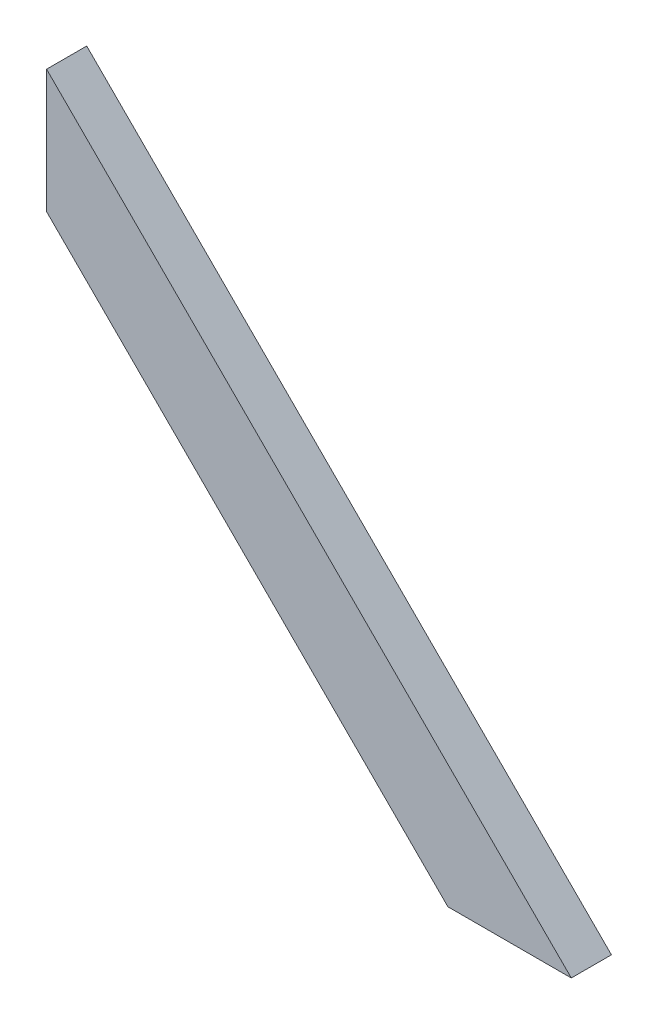
ISO-10303-21;
HEADER;
FILE_DESCRIPTION(('STEP AP214'),'2;1');
FILE_NAME('part.step','',(''),(''),'','','');
FILE_SCHEMA(('AUTOMOTIVE_DESIGN { 1 0 10303 214 1 1 1 1 }'));
ENDSEC;
DATA;
#1=APPLICATION_CONTEXT('core data for automotive mechanical design processes');
#2=APPLICATION_PROTOCOL_DEFINITION('international standard','automotive_design',2000,#1);
#3=PRODUCT_CONTEXT('',#1,'mechanical');
#4=PRODUCT('Part','Part','',(#3));
#5=PRODUCT_RELATED_PRODUCT_CATEGORY('part','',(#4));
#6=PRODUCT_DEFINITION_FORMATION('','',#4);
#7=PRODUCT_DEFINITION_CONTEXT('part definition',#1,'design');
#8=PRODUCT_DEFINITION('design','',#6,#7);
#9=PRODUCT_DEFINITION_SHAPE('','',#8);
#10=(LENGTH_UNIT() NAMED_UNIT(*) SI_UNIT(.MILLI.,.METRE.));
#11=(NAMED_UNIT(*) PLANE_ANGLE_UNIT() SI_UNIT($,.RADIAN.));
#12=(NAMED_UNIT(*) SI_UNIT($,.STERADIAN.) SOLID_ANGLE_UNIT());
#13=UNCERTAINTY_MEASURE_WITH_UNIT(LENGTH_MEASURE(1.E-05),#10,'distance_accuracy_value','');
#14=(GEOMETRIC_REPRESENTATION_CONTEXT(3) GLOBAL_UNCERTAINTY_ASSIGNED_CONTEXT((#13)) GLOBAL_UNIT_ASSIGNED_CONTEXT((#10,
#11,#12)) REPRESENTATION_CONTEXT('',''));
#15=CARTESIAN_POINT('',(0.,0.,0.));
#16=DIRECTION('',(0.,0.,1.));
#17=DIRECTION('',(1.,0.,0.));
#18=AXIS2_PLACEMENT_3D('',#15,#16,#17);
#19=CARTESIAN_POINT('',(0.,202.216763090675,23.));
#20=DIRECTION('',(1.,0.,0.));
#21=DIRECTION('',(0.,1.,0.));
#22=AXIS2_PLACEMENT_3D('',#19,#20,#21);
#23=PLANE('',#22);
#24=DIRECTION('',(0.,-1.,0.));
#25=VECTOR('',#24,1.);
#26=CARTESIAN_POINT('',(0.,202.216763090675,0.));
#27=LINE('',#26,#25);
#28=CARTESIAN_POINT('',(0.,202.216763090675,0.));
#29=VERTEX_POINT('',#28);
#30=CARTESIAN_POINT('',(0.,131.506084972021,0.));
#31=VERTEX_POINT('',#30);
#32=EDGE_CURVE('E95',#29,#31,#27,.T.);
#33=ORIENTED_EDGE('',*,*,#32,.T.);
#34=DIRECTION('',(0.,0.,-1.));
#35=VECTOR('',#34,1.);
#36=CARTESIAN_POINT('',(0.,131.506084972021,23.));
#37=LINE('',#36,#35);
#38=CARTESIAN_POINT('',(0.,131.506084972021,23.));
#39=VERTEX_POINT('',#38);
#40=EDGE_CURVE('E11',#39,#31,#37,.T.);
#41=ORIENTED_EDGE('',*,*,#40,.F.);
#42=DIRECTION('',(0.,-1.,0.));
#43=VECTOR('',#42,1.);
#44=CARTESIAN_POINT('',(0.,202.216763090675,23.));
#45=LINE('',#44,#43);
#46=CARTESIAN_POINT('',(0.,202.216763090675,23.));
#47=VERTEX_POINT('',#46);
#48=EDGE_CURVE('E83',#47,#39,#45,.T.);
#49=ORIENTED_EDGE('',*,*,#48,.F.);
#50=DIRECTION('',(0.,0.,-1.));
#51=VECTOR('',#50,1.);
#52=CARTESIAN_POINT('',(0.,202.216763090675,23.));
#53=LINE('',#52,#51);
#54=EDGE_CURVE('E91',#47,#29,#53,.T.);
#55=ORIENTED_EDGE('',*,*,#54,.T.);
#56=EDGE_LOOP('',(#33,#41,#49,#55));
#57=FACE_BOUND('',#56,.T.);
#58=ADVANCED_FACE('F32',(#57),#23,.F.);
#59=CARTESIAN_POINT('',(0.,131.506084972021,23.));
#60=DIRECTION('',(0.707106781186548,0.707106781186548,0.));
#61=DIRECTION('',(-0.707106781186548,0.707106781186548,0.));
#62=AXIS2_PLACEMENT_3D('',#59,#60,#61);
#63=PLANE('',#62);
#64=DIRECTION('',(0.707106781186547,-0.707106781186547,0.));
#65=VECTOR('',#64,1.);
#66=CARTESIAN_POINT('',(0.,131.506084972021,0.));
#67=LINE('',#66,#65);
#68=CARTESIAN_POINT('',(230.,-98.4939150279795,0.));
#69=VERTEX_POINT('',#68);
#70=EDGE_CURVE('E87',#31,#69,#67,.T.);
#71=ORIENTED_EDGE('',*,*,#70,.T.);
#72=DIRECTION('',(0.,0.,-1.));
#73=VECTOR('',#72,1.);
#74=CARTESIAN_POINT('',(230.,-98.4939150279795,23.));
#75=LINE('',#74,#73);
#76=CARTESIAN_POINT('',(230.,-98.4939150279795,23.));
#77=VERTEX_POINT('',#76);
#78=EDGE_CURVE('E40',#77,#69,#75,.T.);
#79=ORIENTED_EDGE('',*,*,#78,.F.);
#80=DIRECTION('',(0.707106781186547,-0.707106781186547,0.));
#81=VECTOR('',#80,1.);
#82=CARTESIAN_POINT('',(0.,131.506084972021,23.));
#83=LINE('',#82,#81);
#84=EDGE_CURVE('E78',#39,#77,#83,.T.);
#85=ORIENTED_EDGE('',*,*,#84,.F.);
#86=ORIENTED_EDGE('',*,*,#40,.T.);
#87=EDGE_LOOP('',(#71,#79,#85,#86));
#88=FACE_BOUND('',#87,.T.);
#89=ADVANCED_FACE('F86',(#88),#63,.F.);
#90=CARTESIAN_POINT('',(230.,-98.4939150279795,23.));
#91=DIRECTION('',(0.,1.,0.));
#92=DIRECTION('',(-1.,0.,0.));
#93=AXIS2_PLACEMENT_3D('',#90,#91,#92);
#94=PLANE('',#93);
#95=DIRECTION('',(1.,0.,0.));
#96=VECTOR('',#95,1.);
#97=CARTESIAN_POINT('',(230.,-98.4939150279795,0.));
#98=LINE('',#97,#96);
#99=CARTESIAN_POINT('',(300.710678118655,-98.4939150279795,0.));
#100=VERTEX_POINT('',#99);
#101=EDGE_CURVE('E65',#69,#100,#98,.T.);
#102=ORIENTED_EDGE('',*,*,#101,.T.);
#103=DIRECTION('',(0.,0.,-1.));
#104=VECTOR('',#103,1.);
#105=CARTESIAN_POINT('',(300.710678118655,-98.4939150279795,23.));
#106=LINE('',#105,#104);
#107=CARTESIAN_POINT('',(300.710678118655,-98.4939150279795,23.));
#108=VERTEX_POINT('',#107);
#109=EDGE_CURVE('E88',#108,#100,#106,.T.);
#110=ORIENTED_EDGE('',*,*,#109,.F.);
#111=DIRECTION('',(1.,0.,0.));
#112=VECTOR('',#111,1.);
#113=CARTESIAN_POINT('',(230.,-98.4939150279795,23.));
#114=LINE('',#113,#112);
#115=EDGE_CURVE('E81',#77,#108,#114,.T.);
#116=ORIENTED_EDGE('',*,*,#115,.F.);
#117=ORIENTED_EDGE('',*,*,#78,.T.);
#118=EDGE_LOOP('',(#102,#110,#116,#117));
#119=FACE_BOUND('',#118,.T.);
#120=ADVANCED_FACE('F89',(#119),#94,.F.);
#121=CARTESIAN_POINT('',(300.710678118655,-98.4939150279795,23.));
#122=DIRECTION('',(-0.707106781186547,-0.707106781186548,0.));
#123=DIRECTION('',(0.707106781186548,-0.707106781186547,0.));
#124=AXIS2_PLACEMENT_3D('',#121,#122,#123);
#125=PLANE('',#124);
#126=DIRECTION('',(-0.707106781186548,0.707106781186547,0.));
#127=VECTOR('',#126,1.);
#128=CARTESIAN_POINT('',(300.710678118655,-98.4939150279795,0.));
#129=LINE('',#128,#127);
#130=EDGE_CURVE('E71',#100,#29,#129,.T.);
#131=ORIENTED_EDGE('',*,*,#130,.T.);
#132=ORIENTED_EDGE('',*,*,#54,.F.);
#133=DIRECTION('',(-0.707106781186548,0.707106781186547,0.));
#134=VECTOR('',#133,1.);
#135=CARTESIAN_POINT('',(300.710678118655,-98.4939150279795,23.));
#136=LINE('',#135,#134);
#137=EDGE_CURVE('E48',#108,#47,#136,.T.);
#138=ORIENTED_EDGE('',*,*,#137,.F.);
#139=ORIENTED_EDGE('',*,*,#109,.T.);
#140=EDGE_LOOP('',(#131,#132,#138,#139));
#141=FACE_BOUND('',#140,.T.);
#142=ADVANCED_FACE('F102',(#141),#125,.F.);
#143=CARTESIAN_POINT('',(0.,0.,23.));
#144=DIRECTION('',(0.,0.,1.));
#145=DIRECTION('',(1.,0.,0.));
#146=AXIS2_PLACEMENT_3D('',#143,#144,#145);
#147=PLANE('',#146);
#148=ORIENTED_EDGE('',*,*,#48,.T.);
#149=ORIENTED_EDGE('',*,*,#84,.T.);
#150=ORIENTED_EDGE('',*,*,#115,.T.);
#151=ORIENTED_EDGE('',*,*,#137,.T.);
#152=EDGE_LOOP('',(#148,#149,#150,#151));
#153=FACE_BOUND('',#152,.T.);
#154=ADVANCED_FACE('F79',(#153),#147,.T.);
#155=CARTESIAN_POINT('',(0.,0.,0.));
#156=DIRECTION('',(0.,0.,1.));
#157=DIRECTION('',(1.,0.,0.));
#158=AXIS2_PLACEMENT_3D('',#155,#156,#157);
#159=PLANE('',#158);
#160=ORIENTED_EDGE('',*,*,#32,.F.);
#161=ORIENTED_EDGE('',*,*,#130,.F.);
#162=ORIENTED_EDGE('',*,*,#101,.F.);
#163=ORIENTED_EDGE('',*,*,#70,.F.);
#164=EDGE_LOOP('',(#160,#161,#162,#163));
#165=FACE_BOUND('',#164,.T.);
#166=ADVANCED_FACE('F105',(#165),#159,.F.);
#167=CLOSED_SHELL('',(#58,#89,#120,#142,#154,#166));
#168=MANIFOLD_SOLID_BREP('B2',#167);
#169=ADVANCED_BREP_SHAPE_REPRESENTATION('',(#18,#168),#14);
#170=SHAPE_DEFINITION_REPRESENTATION(#9,#169);
ENDSEC;
END-ISO-10303-21;
